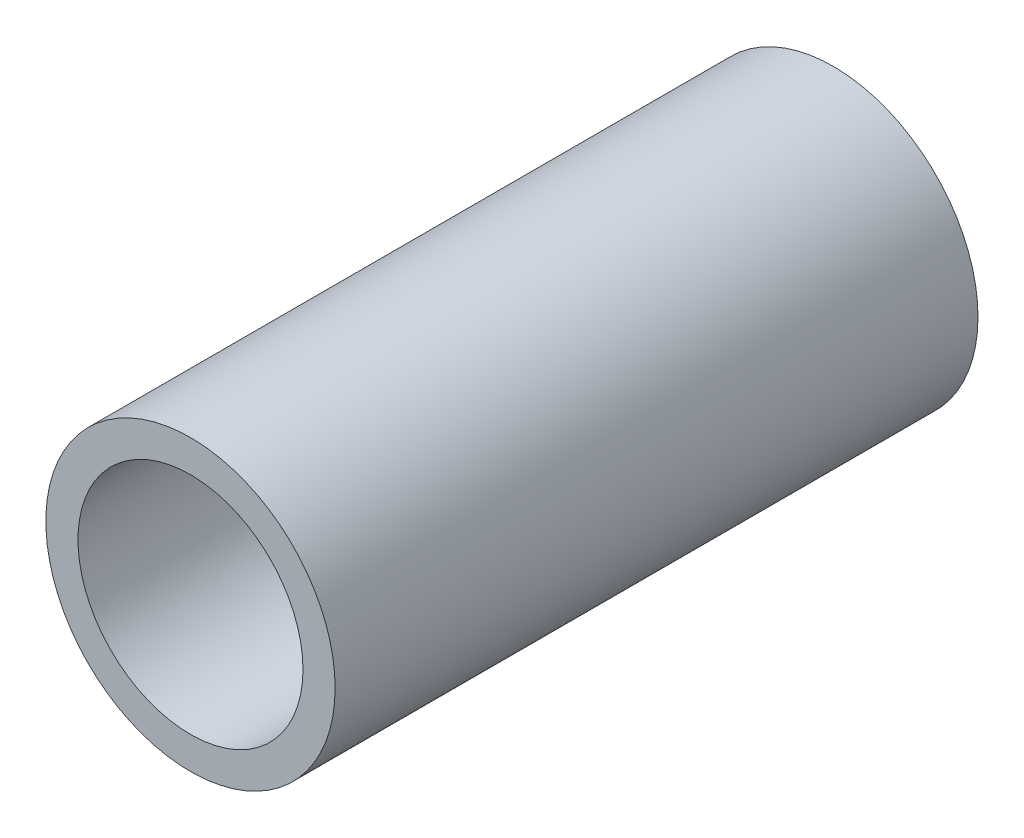
ISO-10303-21;
HEADER;
FILE_DESCRIPTION(('STEP AP214'),'2;1');
FILE_NAME('part.step','',(''),(''),'','','');
FILE_SCHEMA(('AUTOMOTIVE_DESIGN { 1 0 10303 214 1 1 1 1 }'));
ENDSEC;
DATA;
#1=APPLICATION_CONTEXT('core data for automotive mechanical design processes');
#2=APPLICATION_PROTOCOL_DEFINITION('international standard','automotive_design',2000,#1);
#3=PRODUCT_CONTEXT('',#1,'mechanical');
#4=PRODUCT('Part','Part','',(#3));
#5=PRODUCT_RELATED_PRODUCT_CATEGORY('part','',(#4));
#6=PRODUCT_DEFINITION_FORMATION('','',#4);
#7=PRODUCT_DEFINITION_CONTEXT('part definition',#1,'design');
#8=PRODUCT_DEFINITION('design','',#6,#7);
#9=PRODUCT_DEFINITION_SHAPE('','',#8);
#10=(LENGTH_UNIT() NAMED_UNIT(*) SI_UNIT(.MILLI.,.METRE.));
#11=(NAMED_UNIT(*) PLANE_ANGLE_UNIT() SI_UNIT($,.RADIAN.));
#12=(NAMED_UNIT(*) SI_UNIT($,.STERADIAN.) SOLID_ANGLE_UNIT());
#13=UNCERTAINTY_MEASURE_WITH_UNIT(LENGTH_MEASURE(1.E-05),#10,'distance_accuracy_value','');
#14=(GEOMETRIC_REPRESENTATION_CONTEXT(3) GLOBAL_UNCERTAINTY_ASSIGNED_CONTEXT((#13)) GLOBAL_UNIT_ASSIGNED_CONTEXT((#10,
#11,#12)) REPRESENTATION_CONTEXT('',''));
#15=CARTESIAN_POINT('',(0.,0.,0.));
#16=DIRECTION('',(0.,0.,1.));
#17=DIRECTION('',(1.,0.,0.));
#18=AXIS2_PLACEMENT_3D('',#15,#16,#17);
#19=CARTESIAN_POINT('',(0.,0.,20.));
#20=DIRECTION('',(0.,0.,1.));
#21=DIRECTION('',(1.,0.,0.));
#22=AXIS2_PLACEMENT_3D('',#19,#20,#21);
#23=PLANE('',#22);
#24=CARTESIAN_POINT('',(0.,0.,20.));
#25=DIRECTION('',(0.,0.,1.));
#26=DIRECTION('',(1.,0.,0.));
#27=AXIS2_PLACEMENT_3D('',#24,#25,#26);
#28=CIRCLE('',#27,9.);
#29=CARTESIAN_POINT('',(9.,0.,20.));
#30=VERTEX_POINT('',#29);
#31=EDGE_CURVE('E10',#30,#30,#28,.T.);
#32=ORIENTED_EDGE('',*,*,#31,.T.);
#33=EDGE_LOOP('',(#32));
#34=FACE_BOUND('',#33,.T.);
#35=CARTESIAN_POINT('',(0.,0.,20.));
#36=DIRECTION('',(0.,0.,1.));
#37=DIRECTION('',(1.,0.,0.));
#38=AXIS2_PLACEMENT_3D('',#35,#36,#37);
#39=CIRCLE('',#38,7.);
#40=CARTESIAN_POINT('',(7.,0.,20.));
#41=VERTEX_POINT('',#40);
#42=EDGE_CURVE('E50',#41,#41,#39,.T.);
#43=ORIENTED_EDGE('',*,*,#42,.F.);
#44=EDGE_LOOP('',(#43));
#45=FACE_BOUND('',#44,.T.);
#46=ADVANCED_FACE('F37',(#34,#45),#23,.T.);
#47=CARTESIAN_POINT('',(0.,0.,-20.));
#48=DIRECTION('',(0.,0.,1.));
#49=DIRECTION('',(1.,0.,0.));
#50=AXIS2_PLACEMENT_3D('',#47,#48,#49);
#51=PLANE('',#50);
#52=CARTESIAN_POINT('',(0.,0.,-20.));
#53=DIRECTION('',(0.,0.,1.));
#54=DIRECTION('',(1.,0.,0.));
#55=AXIS2_PLACEMENT_3D('',#52,#53,#54);
#56=CIRCLE('',#55,9.);
#57=CARTESIAN_POINT('',(9.,0.,-20.));
#58=VERTEX_POINT('',#57);
#59=EDGE_CURVE('E41',#58,#58,#56,.T.);
#60=ORIENTED_EDGE('',*,*,#59,.F.);
#61=EDGE_LOOP('',(#60));
#62=FACE_BOUND('',#61,.T.);
#63=CARTESIAN_POINT('',(0.,0.,-20.));
#64=DIRECTION('',(0.,0.,1.));
#65=DIRECTION('',(1.,0.,0.));
#66=AXIS2_PLACEMENT_3D('',#63,#64,#65);
#67=CIRCLE('',#66,7.);
#68=CARTESIAN_POINT('',(7.,0.,-20.));
#69=VERTEX_POINT('',#68);
#70=EDGE_CURVE('E52',#69,#69,#67,.T.);
#71=ORIENTED_EDGE('',*,*,#70,.T.);
#72=EDGE_LOOP('',(#71));
#73=FACE_BOUND('',#72,.T.);
#74=ADVANCED_FACE('F64',(#62,#73),#51,.F.);
#75=CARTESIAN_POINT('',(0.,0.,20.));
#76=DIRECTION('',(0.,0.,-1.));
#77=DIRECTION('',(-1.,0.,0.));
#78=AXIS2_PLACEMENT_3D('',#75,#76,#77);
#79=CYLINDRICAL_SURFACE('',#78,9.);
#80=ORIENTED_EDGE('',*,*,#31,.F.);
#81=EDGE_LOOP('',(#80));
#82=FACE_BOUND('',#81,.T.);
#83=ORIENTED_EDGE('',*,*,#59,.T.);
#84=EDGE_LOOP('',(#83));
#85=FACE_BOUND('',#84,.T.);
#86=ADVANCED_FACE('F39',(#82,#85),#79,.T.);
#87=CARTESIAN_POINT('',(0.,0.,20.));
#88=DIRECTION('',(0.,0.,-1.));
#89=DIRECTION('',(-1.,0.,0.));
#90=AXIS2_PLACEMENT_3D('',#87,#88,#89);
#91=CYLINDRICAL_SURFACE('',#90,7.);
#92=ORIENTED_EDGE('',*,*,#42,.T.);
#93=EDGE_LOOP('',(#92));
#94=FACE_BOUND('',#93,.T.);
#95=ORIENTED_EDGE('',*,*,#70,.F.);
#96=EDGE_LOOP('',(#95));
#97=FACE_BOUND('',#96,.T.);
#98=ADVANCED_FACE('F60',(#94,#97),#91,.F.);
#99=CLOSED_SHELL('',(#46,#74,#86,#98));
#100=MANIFOLD_SOLID_BREP('B2',#99);
#101=ADVANCED_BREP_SHAPE_REPRESENTATION('',(#18,#100),#14);
#102=SHAPE_DEFINITION_REPRESENTATION(#9,#101);
ENDSEC;
END-ISO-10303-21;
